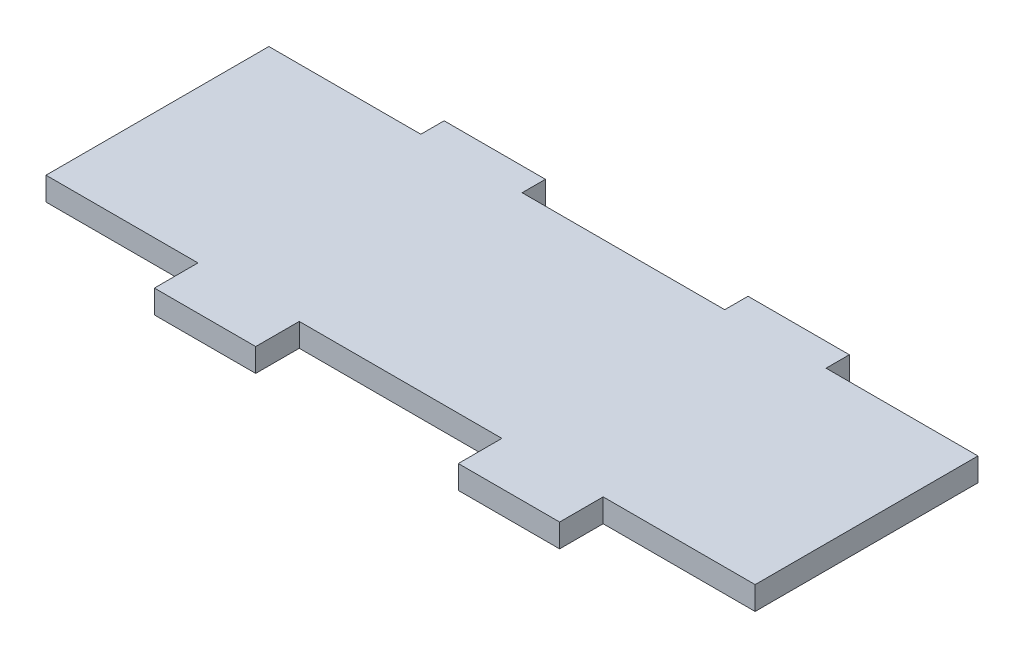
ISO-10303-21;
HEADER;
FILE_DESCRIPTION(('STEP AP214'),'2;1');
FILE_NAME('part.step','',(''),(''),'','','');
FILE_SCHEMA(('AUTOMOTIVE_DESIGN { 1 0 10303 214 1 1 1 1 }'));
ENDSEC;
DATA;
#1=APPLICATION_CONTEXT('core data for automotive mechanical design processes');
#2=APPLICATION_PROTOCOL_DEFINITION('international standard','automotive_design',2000,#1);
#3=PRODUCT_CONTEXT('',#1,'mechanical');
#4=PRODUCT('Part','Part','',(#3));
#5=PRODUCT_RELATED_PRODUCT_CATEGORY('part','',(#4));
#6=PRODUCT_DEFINITION_FORMATION('','',#4);
#7=PRODUCT_DEFINITION_CONTEXT('part definition',#1,'design');
#8=PRODUCT_DEFINITION('design','',#6,#7);
#9=PRODUCT_DEFINITION_SHAPE('','',#8);
#10=(LENGTH_UNIT() NAMED_UNIT(*) SI_UNIT(.MILLI.,.METRE.));
#11=(NAMED_UNIT(*) PLANE_ANGLE_UNIT() SI_UNIT($,.RADIAN.));
#12=(NAMED_UNIT(*) SI_UNIT($,.STERADIAN.) SOLID_ANGLE_UNIT());
#13=UNCERTAINTY_MEASURE_WITH_UNIT(LENGTH_MEASURE(1.E-05),#10,'distance_accuracy_value','');
#14=(GEOMETRIC_REPRESENTATION_CONTEXT(3) GLOBAL_UNCERTAINTY_ASSIGNED_CONTEXT((#13)) GLOBAL_UNIT_ASSIGNED_CONTEXT((#10,
#11,#12)) REPRESENTATION_CONTEXT('',''));
#15=CARTESIAN_POINT('',(0.,0.,0.));
#16=DIRECTION('',(0.,0.,1.));
#17=DIRECTION('',(1.,0.,0.));
#18=AXIS2_PLACEMENT_3D('',#15,#16,#17);
#19=CARTESIAN_POINT('',(0.,2.3,0.));
#20=DIRECTION('',(0.,0.,-1.));
#21=DIRECTION('',(-1.,0.,0.));
#22=AXIS2_PLACEMENT_3D('',#19,#20,#21);
#23=PLANE('',#22);
#24=DIRECTION('',(1.,0.,0.));
#25=VECTOR('',#24,1.);
#26=CARTESIAN_POINT('',(0.,0.,0.));
#27=LINE('',#26,#25);
#28=CARTESIAN_POINT('',(0.,0.,0.));
#29=VERTEX_POINT('',#28);
#30=CARTESIAN_POINT('',(15.,0.,0.));
#31=VERTEX_POINT('',#30);
#32=EDGE_CURVE('E201',#29,#31,#27,.T.);
#33=ORIENTED_EDGE('',*,*,#32,.T.);
#34=DIRECTION('',(0.,-1.,0.));
#35=VECTOR('',#34,1.);
#36=CARTESIAN_POINT('',(15.,2.3,0.));
#37=LINE('',#36,#35);
#38=CARTESIAN_POINT('',(15.,2.3,0.));
#39=VERTEX_POINT('',#38);
#40=EDGE_CURVE('E11',#39,#31,#37,.T.);
#41=ORIENTED_EDGE('',*,*,#40,.F.);
#42=DIRECTION('',(1.,0.,0.));
#43=VECTOR('',#42,1.);
#44=CARTESIAN_POINT('',(0.,2.3,0.));
#45=LINE('',#44,#43);
#46=CARTESIAN_POINT('',(0.,2.3,0.));
#47=VERTEX_POINT('',#46);
#48=EDGE_CURVE('E239',#47,#39,#45,.T.);
#49=ORIENTED_EDGE('',*,*,#48,.F.);
#50=DIRECTION('',(0.,-1.,0.));
#51=VECTOR('',#50,1.);
#52=CARTESIAN_POINT('',(0.,2.3,0.));
#53=LINE('',#52,#51);
#54=EDGE_CURVE('E197',#47,#29,#53,.T.);
#55=ORIENTED_EDGE('',*,*,#54,.T.);
#56=EDGE_LOOP('',(#33,#41,#49,#55));
#57=FACE_BOUND('',#56,.T.);
#58=ADVANCED_FACE('F33',(#57),#23,.F.);
#59=CARTESIAN_POINT('',(15.,2.3,0.));
#60=DIRECTION('',(1.,0.,0.));
#61=DIRECTION('',(0.,0.,-1.));
#62=AXIS2_PLACEMENT_3D('',#59,#60,#61);
#63=PLANE('',#62);
#64=DIRECTION('',(0.,0.,1.));
#65=VECTOR('',#64,1.);
#66=CARTESIAN_POINT('',(15.,0.,0.));
#67=LINE('',#66,#65);
#68=CARTESIAN_POINT('',(15.,0.,4.3));
#69=VERTEX_POINT('',#68);
#70=EDGE_CURVE('E204',#31,#69,#67,.T.);
#71=ORIENTED_EDGE('',*,*,#70,.T.);
#72=DIRECTION('',(0.,-1.,0.));
#73=VECTOR('',#72,1.);
#74=CARTESIAN_POINT('',(15.,2.3,4.3));
#75=LINE('',#74,#73);
#76=CARTESIAN_POINT('',(15.,2.3,4.3));
#77=VERTEX_POINT('',#76);
#78=EDGE_CURVE('E41',#77,#69,#75,.T.);
#79=ORIENTED_EDGE('',*,*,#78,.F.);
#80=DIRECTION('',(0.,0.,1.));
#81=VECTOR('',#80,1.);
#82=CARTESIAN_POINT('',(15.,2.3,0.));
#83=LINE('',#82,#81);
#84=EDGE_CURVE('E128',#39,#77,#83,.T.);
#85=ORIENTED_EDGE('',*,*,#84,.F.);
#86=ORIENTED_EDGE('',*,*,#40,.T.);
#87=EDGE_LOOP('',(#71,#79,#85,#86));
#88=FACE_BOUND('',#87,.T.);
#89=ADVANCED_FACE('F357',(#88),#63,.F.);
#90=CARTESIAN_POINT('',(15.,2.3,4.3));
#91=DIRECTION('',(0.,0.,-1.));
#92=DIRECTION('',(-1.,0.,0.));
#93=AXIS2_PLACEMENT_3D('',#90,#91,#92);
#94=PLANE('',#93);
#95=DIRECTION('',(1.,0.,0.));
#96=VECTOR('',#95,1.);
#97=CARTESIAN_POINT('',(15.,0.,4.3));
#98=LINE('',#97,#96);
#99=CARTESIAN_POINT('',(25.,0.,4.3));
#100=VERTEX_POINT('',#99);
#101=EDGE_CURVE('E206',#69,#100,#98,.T.);
#102=ORIENTED_EDGE('',*,*,#101,.T.);
#103=DIRECTION('',(0.,-1.,0.));
#104=VECTOR('',#103,1.);
#105=CARTESIAN_POINT('',(25.,2.3,4.3));
#106=LINE('',#105,#104);
#107=CARTESIAN_POINT('',(25.,2.3,4.3));
#108=VERTEX_POINT('',#107);
#109=EDGE_CURVE('E282',#108,#100,#106,.T.);
#110=ORIENTED_EDGE('',*,*,#109,.F.);
#111=DIRECTION('',(1.,0.,0.));
#112=VECTOR('',#111,1.);
#113=CARTESIAN_POINT('',(15.,2.3,4.3));
#114=LINE('',#113,#112);
#115=EDGE_CURVE('E290',#77,#108,#114,.T.);
#116=ORIENTED_EDGE('',*,*,#115,.F.);
#117=ORIENTED_EDGE('',*,*,#78,.T.);
#118=EDGE_LOOP('',(#102,#110,#116,#117));
#119=FACE_BOUND('',#118,.T.);
#120=ADVANCED_FACE('F288',(#119),#94,.F.);
#121=CARTESIAN_POINT('',(25.,2.3,4.3));
#122=DIRECTION('',(-1.,0.,0.));
#123=DIRECTION('',(0.,0.,1.));
#124=AXIS2_PLACEMENT_3D('',#121,#122,#123);
#125=PLANE('',#124);
#126=DIRECTION('',(0.,0.,-1.));
#127=VECTOR('',#126,1.);
#128=CARTESIAN_POINT('',(25.,0.,4.3));
#129=LINE('',#128,#127);
#130=CARTESIAN_POINT('',(25.,0.,0.));
#131=VERTEX_POINT('',#130);
#132=EDGE_CURVE('E208',#100,#131,#129,.T.);
#133=ORIENTED_EDGE('',*,*,#132,.T.);
#134=DIRECTION('',(0.,-1.,0.));
#135=VECTOR('',#134,1.);
#136=CARTESIAN_POINT('',(25.,2.3,0.));
#137=LINE('',#136,#135);
#138=CARTESIAN_POINT('',(25.,2.3,0.));
#139=VERTEX_POINT('',#138);
#140=EDGE_CURVE('E279',#139,#131,#137,.T.);
#141=ORIENTED_EDGE('',*,*,#140,.F.);
#142=DIRECTION('',(0.,0.,-1.));
#143=VECTOR('',#142,1.);
#144=CARTESIAN_POINT('',(25.,2.3,4.3));
#145=LINE('',#144,#143);
#146=EDGE_CURVE('E308',#108,#139,#145,.T.);
#147=ORIENTED_EDGE('',*,*,#146,.F.);
#148=ORIENTED_EDGE('',*,*,#109,.T.);
#149=EDGE_LOOP('',(#133,#141,#147,#148));
#150=FACE_BOUND('',#149,.T.);
#151=ADVANCED_FACE('F299',(#150),#125,.F.);
#152=CARTESIAN_POINT('',(25.,2.3,0.));
#153=DIRECTION('',(0.,0.,-1.));
#154=DIRECTION('',(-1.,0.,0.));
#155=AXIS2_PLACEMENT_3D('',#152,#153,#154);
#156=PLANE('',#155);
#157=DIRECTION('',(1.,0.,0.));
#158=VECTOR('',#157,1.);
#159=CARTESIAN_POINT('',(25.,0.,0.));
#160=LINE('',#159,#158);
#161=CARTESIAN_POINT('',(45.,0.,0.));
#162=VERTEX_POINT('',#161);
#163=EDGE_CURVE('E210',#131,#162,#160,.T.);
#164=ORIENTED_EDGE('',*,*,#163,.T.);
#165=DIRECTION('',(0.,-1.,0.));
#166=VECTOR('',#165,1.);
#167=CARTESIAN_POINT('',(45.,2.3,0.));
#168=LINE('',#167,#166);
#169=CARTESIAN_POINT('',(45.,2.3,0.));
#170=VERTEX_POINT('',#169);
#171=EDGE_CURVE('E276',#170,#162,#168,.T.);
#172=ORIENTED_EDGE('',*,*,#171,.F.);
#173=DIRECTION('',(1.,0.,0.));
#174=VECTOR('',#173,1.);
#175=CARTESIAN_POINT('',(25.,2.3,0.));
#176=LINE('',#175,#174);
#177=EDGE_CURVE('E305',#139,#170,#176,.T.);
#178=ORIENTED_EDGE('',*,*,#177,.F.);
#179=ORIENTED_EDGE('',*,*,#140,.T.);
#180=EDGE_LOOP('',(#164,#172,#178,#179));
#181=FACE_BOUND('',#180,.T.);
#182=ADVANCED_FACE('F303',(#181),#156,.F.);
#183=CARTESIAN_POINT('',(45.,2.3,0.));
#184=DIRECTION('',(1.,0.,0.));
#185=DIRECTION('',(0.,0.,-1.));
#186=AXIS2_PLACEMENT_3D('',#183,#184,#185);
#187=PLANE('',#186);
#188=DIRECTION('',(0.,0.,1.));
#189=VECTOR('',#188,1.);
#190=CARTESIAN_POINT('',(45.,0.,0.));
#191=LINE('',#190,#189);
#192=CARTESIAN_POINT('',(45.,0.,4.3));
#193=VERTEX_POINT('',#192);
#194=EDGE_CURVE('E212',#162,#193,#191,.T.);
#195=ORIENTED_EDGE('',*,*,#194,.T.);
#196=DIRECTION('',(0.,-1.,0.));
#197=VECTOR('',#196,1.);
#198=CARTESIAN_POINT('',(45.,2.3,4.3));
#199=LINE('',#198,#197);
#200=CARTESIAN_POINT('',(45.,2.3,4.3));
#201=VERTEX_POINT('',#200);
#202=EDGE_CURVE('E273',#201,#193,#199,.T.);
#203=ORIENTED_EDGE('',*,*,#202,.F.);
#204=DIRECTION('',(0.,0.,1.));
#205=VECTOR('',#204,1.);
#206=CARTESIAN_POINT('',(45.,2.3,0.));
#207=LINE('',#206,#205);
#208=EDGE_CURVE('E307',#170,#201,#207,.T.);
#209=ORIENTED_EDGE('',*,*,#208,.F.);
#210=ORIENTED_EDGE('',*,*,#171,.T.);
#211=EDGE_LOOP('',(#195,#203,#209,#210));
#212=FACE_BOUND('',#211,.T.);
#213=ADVANCED_FACE('F370',(#212),#187,.F.);
#214=CARTESIAN_POINT('',(45.,2.3,4.3));
#215=DIRECTION('',(0.,0.,-1.));
#216=DIRECTION('',(-1.,0.,0.));
#217=AXIS2_PLACEMENT_3D('',#214,#215,#216);
#218=PLANE('',#217);
#219=DIRECTION('',(1.,0.,0.));
#220=VECTOR('',#219,1.);
#221=CARTESIAN_POINT('',(45.,0.,4.3));
#222=LINE('',#221,#220);
#223=CARTESIAN_POINT('',(55.,0.,4.3));
#224=VERTEX_POINT('',#223);
#225=EDGE_CURVE('E214',#193,#224,#222,.T.);
#226=ORIENTED_EDGE('',*,*,#225,.T.);
#227=DIRECTION('',(0.,-1.,0.));
#228=VECTOR('',#227,1.);
#229=CARTESIAN_POINT('',(55.,2.3,4.3));
#230=LINE('',#229,#228);
#231=CARTESIAN_POINT('',(55.,2.3,4.3));
#232=VERTEX_POINT('',#231);
#233=EDGE_CURVE('E270',#232,#224,#230,.T.);
#234=ORIENTED_EDGE('',*,*,#233,.F.);
#235=DIRECTION('',(1.,0.,0.));
#236=VECTOR('',#235,1.);
#237=CARTESIAN_POINT('',(45.,2.3,4.3));
#238=LINE('',#237,#236);
#239=EDGE_CURVE('E310',#201,#232,#238,.T.);
#240=ORIENTED_EDGE('',*,*,#239,.F.);
#241=ORIENTED_EDGE('',*,*,#202,.T.);
#242=EDGE_LOOP('',(#226,#234,#240,#241));
#243=FACE_BOUND('',#242,.T.);
#244=ADVANCED_FACE('F373',(#243),#218,.F.);
#245=CARTESIAN_POINT('',(55.,2.3,4.3));
#246=DIRECTION('',(-1.,0.,0.));
#247=DIRECTION('',(0.,0.,1.));
#248=AXIS2_PLACEMENT_3D('',#245,#246,#247);
#249=PLANE('',#248);
#250=DIRECTION('',(0.,0.,-1.));
#251=VECTOR('',#250,1.);
#252=CARTESIAN_POINT('',(55.,0.,4.3));
#253=LINE('',#252,#251);
#254=CARTESIAN_POINT('',(55.,0.,0.));
#255=VERTEX_POINT('',#254);
#256=EDGE_CURVE('E216',#224,#255,#253,.T.);
#257=ORIENTED_EDGE('',*,*,#256,.T.);
#258=DIRECTION('',(0.,-1.,0.));
#259=VECTOR('',#258,1.);
#260=CARTESIAN_POINT('',(55.,2.3,0.));
#261=LINE('',#260,#259);
#262=CARTESIAN_POINT('',(55.,2.3,0.));
#263=VERTEX_POINT('',#262);
#264=EDGE_CURVE('E267',#263,#255,#261,.T.);
#265=ORIENTED_EDGE('',*,*,#264,.F.);
#266=DIRECTION('',(0.,0.,-1.));
#267=VECTOR('',#266,1.);
#268=CARTESIAN_POINT('',(55.,2.3,4.3));
#269=LINE('',#268,#267);
#270=EDGE_CURVE('E316',#232,#263,#269,.T.);
#271=ORIENTED_EDGE('',*,*,#270,.F.);
#272=ORIENTED_EDGE('',*,*,#233,.T.);
#273=EDGE_LOOP('',(#257,#265,#271,#272));
#274=FACE_BOUND('',#273,.T.);
#275=ADVANCED_FACE('F377',(#274),#249,.F.);
#276=CARTESIAN_POINT('',(55.,2.3,0.));
#277=DIRECTION('',(0.,0.,-1.));
#278=DIRECTION('',(-1.,0.,0.));
#279=AXIS2_PLACEMENT_3D('',#276,#277,#278);
#280=PLANE('',#279);
#281=DIRECTION('',(1.,0.,0.));
#282=VECTOR('',#281,1.);
#283=CARTESIAN_POINT('',(55.,0.,0.));
#284=LINE('',#283,#282);
#285=CARTESIAN_POINT('',(70.,0.,0.));
#286=VERTEX_POINT('',#285);
#287=EDGE_CURVE('E218',#255,#286,#284,.T.);
#288=ORIENTED_EDGE('',*,*,#287,.T.);
#289=DIRECTION('',(0.,-1.,0.));
#290=VECTOR('',#289,1.);
#291=CARTESIAN_POINT('',(70.,2.3,0.));
#292=LINE('',#291,#290);
#293=CARTESIAN_POINT('',(70.,2.3,0.));
#294=VERTEX_POINT('',#293);
#295=EDGE_CURVE('E264',#294,#286,#292,.T.);
#296=ORIENTED_EDGE('',*,*,#295,.F.);
#297=DIRECTION('',(1.,0.,0.));
#298=VECTOR('',#297,1.);
#299=CARTESIAN_POINT('',(55.,2.3,0.));
#300=LINE('',#299,#298);
#301=EDGE_CURVE('E318',#263,#294,#300,.T.);
#302=ORIENTED_EDGE('',*,*,#301,.F.);
#303=ORIENTED_EDGE('',*,*,#264,.T.);
#304=EDGE_LOOP('',(#288,#296,#302,#303));
#305=FACE_BOUND('',#304,.T.);
#306=ADVANCED_FACE('F381',(#305),#280,.F.);
#307=CARTESIAN_POINT('',(70.,2.3,-22.));
#308=DIRECTION('',(-1.,0.,0.));
#309=DIRECTION('',(0.,0.,1.));
#310=AXIS2_PLACEMENT_3D('',#307,#308,#309);
#311=PLANE('',#310);
#312=DIRECTION('',(0.,0.,-1.));
#313=VECTOR('',#312,1.);
#314=CARTESIAN_POINT('',(70.,0.,-22.));
#315=LINE('',#314,#313);
#316=CARTESIAN_POINT('',(70.,0.,-22.));
#317=VERTEX_POINT('',#316);
#318=EDGE_CURVE('E220',#286,#317,#315,.T.);
#319=ORIENTED_EDGE('',*,*,#318,.T.);
#320=DIRECTION('',(0.,-1.,0.));
#321=VECTOR('',#320,1.);
#322=CARTESIAN_POINT('',(70.,2.3,-22.));
#323=LINE('',#322,#321);
#324=CARTESIAN_POINT('',(70.,2.3,-22.));
#325=VERTEX_POINT('',#324);
#326=EDGE_CURVE('E261',#325,#317,#323,.T.);
#327=ORIENTED_EDGE('',*,*,#326,.F.);
#328=DIRECTION('',(0.,0.,-1.));
#329=VECTOR('',#328,1.);
#330=CARTESIAN_POINT('',(70.,2.3,-22.));
#331=LINE('',#330,#329);
#332=EDGE_CURVE('E320',#294,#325,#331,.T.);
#333=ORIENTED_EDGE('',*,*,#332,.F.);
#334=ORIENTED_EDGE('',*,*,#295,.T.);
#335=EDGE_LOOP('',(#319,#327,#333,#334));
#336=FACE_BOUND('',#335,.T.);
#337=ADVANCED_FACE('F385',(#336),#311,.F.);
#338=CARTESIAN_POINT('',(55.,2.3,-22.));
#339=DIRECTION('',(0.,0.,1.));
#340=DIRECTION('',(1.,0.,0.));
#341=AXIS2_PLACEMENT_3D('',#338,#339,#340);
#342=PLANE('',#341);
#343=DIRECTION('',(-1.,0.,0.));
#344=VECTOR('',#343,1.);
#345=CARTESIAN_POINT('',(55.,0.,-22.));
#346=LINE('',#345,#344);
#347=CARTESIAN_POINT('',(55.,0.,-22.));
#348=VERTEX_POINT('',#347);
#349=EDGE_CURVE('E222',#317,#348,#346,.T.);
#350=ORIENTED_EDGE('',*,*,#349,.T.);
#351=DIRECTION('',(0.,-1.,0.));
#352=VECTOR('',#351,1.);
#353=CARTESIAN_POINT('',(55.,2.3,-22.));
#354=LINE('',#353,#352);
#355=CARTESIAN_POINT('',(55.,2.3,-22.));
#356=VERTEX_POINT('',#355);
#357=EDGE_CURVE('E258',#356,#348,#354,.T.);
#358=ORIENTED_EDGE('',*,*,#357,.F.);
#359=DIRECTION('',(-1.,0.,0.));
#360=VECTOR('',#359,1.);
#361=CARTESIAN_POINT('',(55.,2.3,-22.));
#362=LINE('',#361,#360);
#363=EDGE_CURVE('E322',#325,#356,#362,.T.);
#364=ORIENTED_EDGE('',*,*,#363,.F.);
#365=ORIENTED_EDGE('',*,*,#326,.T.);
#366=EDGE_LOOP('',(#350,#358,#364,#365));
#367=FACE_BOUND('',#366,.T.);
#368=ADVANCED_FACE('F389',(#367),#342,.F.);
#369=CARTESIAN_POINT('',(55.,2.3,-24.3));
#370=DIRECTION('',(-1.,0.,0.));
#371=DIRECTION('',(0.,0.,1.));
#372=AXIS2_PLACEMENT_3D('',#369,#370,#371);
#373=PLANE('',#372);
#374=DIRECTION('',(0.,0.,-1.));
#375=VECTOR('',#374,1.);
#376=CARTESIAN_POINT('',(55.,0.,-24.3));
#377=LINE('',#376,#375);
#378=CARTESIAN_POINT('',(55.,0.,-24.3));
#379=VERTEX_POINT('',#378);
#380=EDGE_CURVE('E224',#348,#379,#377,.T.);
#381=ORIENTED_EDGE('',*,*,#380,.T.);
#382=DIRECTION('',(0.,-1.,0.));
#383=VECTOR('',#382,1.);
#384=CARTESIAN_POINT('',(55.,2.3,-24.3));
#385=LINE('',#384,#383);
#386=CARTESIAN_POINT('',(55.,2.3,-24.3));
#387=VERTEX_POINT('',#386);
#388=EDGE_CURVE('E255',#387,#379,#385,.T.);
#389=ORIENTED_EDGE('',*,*,#388,.F.);
#390=DIRECTION('',(0.,0.,-1.));
#391=VECTOR('',#390,1.);
#392=CARTESIAN_POINT('',(55.,2.3,-24.3));
#393=LINE('',#392,#391);
#394=EDGE_CURVE('E324',#356,#387,#393,.T.);
#395=ORIENTED_EDGE('',*,*,#394,.F.);
#396=ORIENTED_EDGE('',*,*,#357,.T.);
#397=EDGE_LOOP('',(#381,#389,#395,#396));
#398=FACE_BOUND('',#397,.T.);
#399=ADVANCED_FACE('F393',(#398),#373,.F.);
#400=CARTESIAN_POINT('',(45.,2.3,-24.3));
#401=DIRECTION('',(0.,0.,1.));
#402=DIRECTION('',(1.,0.,0.));
#403=AXIS2_PLACEMENT_3D('',#400,#401,#402);
#404=PLANE('',#403);
#405=DIRECTION('',(-1.,0.,0.));
#406=VECTOR('',#405,1.);
#407=CARTESIAN_POINT('',(45.,0.,-24.3));
#408=LINE('',#407,#406);
#409=CARTESIAN_POINT('',(45.,0.,-24.3));
#410=VERTEX_POINT('',#409);
#411=EDGE_CURVE('E226',#379,#410,#408,.T.);
#412=ORIENTED_EDGE('',*,*,#411,.T.);
#413=DIRECTION('',(0.,-1.,0.));
#414=VECTOR('',#413,1.);
#415=CARTESIAN_POINT('',(45.,2.3,-24.3));
#416=LINE('',#415,#414);
#417=CARTESIAN_POINT('',(45.,2.3,-24.3));
#418=VERTEX_POINT('',#417);
#419=EDGE_CURVE('E252',#418,#410,#416,.T.);
#420=ORIENTED_EDGE('',*,*,#419,.F.);
#421=DIRECTION('',(-1.,0.,0.));
#422=VECTOR('',#421,1.);
#423=CARTESIAN_POINT('',(45.,2.3,-24.3));
#424=LINE('',#423,#422);
#425=EDGE_CURVE('E326',#387,#418,#424,.T.);
#426=ORIENTED_EDGE('',*,*,#425,.F.);
#427=ORIENTED_EDGE('',*,*,#388,.T.);
#428=EDGE_LOOP('',(#412,#420,#426,#427));
#429=FACE_BOUND('',#428,.T.);
#430=ADVANCED_FACE('F397',(#429),#404,.F.);
#431=CARTESIAN_POINT('',(45.,2.3,-22.));
#432=DIRECTION('',(1.,0.,0.));
#433=DIRECTION('',(0.,0.,-1.));
#434=AXIS2_PLACEMENT_3D('',#431,#432,#433);
#435=PLANE('',#434);
#436=DIRECTION('',(0.,0.,1.));
#437=VECTOR('',#436,1.);
#438=CARTESIAN_POINT('',(45.,0.,-22.));
#439=LINE('',#438,#437);
#440=CARTESIAN_POINT('',(45.,0.,-22.));
#441=VERTEX_POINT('',#440);
#442=EDGE_CURVE('E228',#410,#441,#439,.T.);
#443=ORIENTED_EDGE('',*,*,#442,.T.);
#444=DIRECTION('',(0.,-1.,0.));
#445=VECTOR('',#444,1.);
#446=CARTESIAN_POINT('',(45.,2.3,-22.));
#447=LINE('',#446,#445);
#448=CARTESIAN_POINT('',(45.,2.3,-22.));
#449=VERTEX_POINT('',#448);
#450=EDGE_CURVE('E249',#449,#441,#447,.T.);
#451=ORIENTED_EDGE('',*,*,#450,.F.);
#452=DIRECTION('',(0.,0.,1.));
#453=VECTOR('',#452,1.);
#454=CARTESIAN_POINT('',(45.,2.3,-22.));
#455=LINE('',#454,#453);
#456=EDGE_CURVE('E328',#418,#449,#455,.T.);
#457=ORIENTED_EDGE('',*,*,#456,.F.);
#458=ORIENTED_EDGE('',*,*,#419,.T.);
#459=EDGE_LOOP('',(#443,#451,#457,#458));
#460=FACE_BOUND('',#459,.T.);
#461=ADVANCED_FACE('F401',(#460),#435,.F.);
#462=CARTESIAN_POINT('',(25.,2.3,-22.));
#463=DIRECTION('',(0.,0.,1.));
#464=DIRECTION('',(1.,0.,0.));
#465=AXIS2_PLACEMENT_3D('',#462,#463,#464);
#466=PLANE('',#465);
#467=DIRECTION('',(-1.,0.,0.));
#468=VECTOR('',#467,1.);
#469=CARTESIAN_POINT('',(25.,0.,-22.));
#470=LINE('',#469,#468);
#471=CARTESIAN_POINT('',(25.,0.,-22.));
#472=VERTEX_POINT('',#471);
#473=EDGE_CURVE('E230',#441,#472,#470,.T.);
#474=ORIENTED_EDGE('',*,*,#473,.T.);
#475=DIRECTION('',(0.,-1.,0.));
#476=VECTOR('',#475,1.);
#477=CARTESIAN_POINT('',(25.,2.3,-22.));
#478=LINE('',#477,#476);
#479=CARTESIAN_POINT('',(25.,2.3,-22.));
#480=VERTEX_POINT('',#479);
#481=EDGE_CURVE('E246',#480,#472,#478,.T.);
#482=ORIENTED_EDGE('',*,*,#481,.F.);
#483=DIRECTION('',(-1.,0.,0.));
#484=VECTOR('',#483,1.);
#485=CARTESIAN_POINT('',(25.,2.3,-22.));
#486=LINE('',#485,#484);
#487=EDGE_CURVE('E330',#449,#480,#486,.T.);
#488=ORIENTED_EDGE('',*,*,#487,.F.);
#489=ORIENTED_EDGE('',*,*,#450,.T.);
#490=EDGE_LOOP('',(#474,#482,#488,#489));
#491=FACE_BOUND('',#490,.T.);
#492=ADVANCED_FACE('F405',(#491),#466,.F.);
#493=CARTESIAN_POINT('',(25.,2.3,-24.3));
#494=DIRECTION('',(-1.,0.,0.));
#495=DIRECTION('',(0.,0.,1.));
#496=AXIS2_PLACEMENT_3D('',#493,#494,#495);
#497=PLANE('',#496);
#498=DIRECTION('',(0.,0.,-1.));
#499=VECTOR('',#498,1.);
#500=CARTESIAN_POINT('',(25.,0.,-24.3));
#501=LINE('',#500,#499);
#502=CARTESIAN_POINT('',(25.,0.,-24.3));
#503=VERTEX_POINT('',#502);
#504=EDGE_CURVE('E232',#472,#503,#501,.T.);
#505=ORIENTED_EDGE('',*,*,#504,.T.);
#506=DIRECTION('',(0.,-1.,0.));
#507=VECTOR('',#506,1.);
#508=CARTESIAN_POINT('',(25.,2.3,-24.3));
#509=LINE('',#508,#507);
#510=CARTESIAN_POINT('',(25.,2.3,-24.3));
#511=VERTEX_POINT('',#510);
#512=EDGE_CURVE('E243',#511,#503,#509,.T.);
#513=ORIENTED_EDGE('',*,*,#512,.F.);
#514=DIRECTION('',(0.,0.,-1.));
#515=VECTOR('',#514,1.);
#516=CARTESIAN_POINT('',(25.,2.3,-24.3));
#517=LINE('',#516,#515);
#518=EDGE_CURVE('E332',#480,#511,#517,.T.);
#519=ORIENTED_EDGE('',*,*,#518,.F.);
#520=ORIENTED_EDGE('',*,*,#481,.T.);
#521=EDGE_LOOP('',(#505,#513,#519,#520));
#522=FACE_BOUND('',#521,.T.);
#523=ADVANCED_FACE('F338',(#522),#497,.F.);
#524=CARTESIAN_POINT('',(15.,2.3,-24.3));
#525=DIRECTION('',(0.,0.,1.));
#526=DIRECTION('',(1.,0.,0.));
#527=AXIS2_PLACEMENT_3D('',#524,#525,#526);
#528=PLANE('',#527);
#529=DIRECTION('',(-1.,0.,0.));
#530=VECTOR('',#529,1.);
#531=CARTESIAN_POINT('',(15.,0.,-24.3));
#532=LINE('',#531,#530);
#533=CARTESIAN_POINT('',(15.,0.,-24.3));
#534=VERTEX_POINT('',#533);
#535=EDGE_CURVE('E234',#503,#534,#532,.T.);
#536=ORIENTED_EDGE('',*,*,#535,.T.);
#537=DIRECTION('',(0.,-1.,0.));
#538=VECTOR('',#537,1.);
#539=CARTESIAN_POINT('',(15.,2.3,-24.3));
#540=LINE('',#539,#538);
#541=CARTESIAN_POINT('',(15.,2.3,-24.3));
#542=VERTEX_POINT('',#541);
#543=EDGE_CURVE('E192',#542,#534,#540,.T.);
#544=ORIENTED_EDGE('',*,*,#543,.F.);
#545=DIRECTION('',(-1.,0.,0.));
#546=VECTOR('',#545,1.);
#547=CARTESIAN_POINT('',(15.,2.3,-24.3));
#548=LINE('',#547,#546);
#549=EDGE_CURVE('E183',#511,#542,#548,.T.);
#550=ORIENTED_EDGE('',*,*,#549,.F.);
#551=ORIENTED_EDGE('',*,*,#512,.T.);
#552=EDGE_LOOP('',(#536,#544,#550,#551));
#553=FACE_BOUND('',#552,.T.);
#554=ADVANCED_FACE('F342',(#553),#528,.F.);
#555=CARTESIAN_POINT('',(15.,2.3,-22.));
#556=DIRECTION('',(1.,0.,0.));
#557=DIRECTION('',(0.,0.,-1.));
#558=AXIS2_PLACEMENT_3D('',#555,#556,#557);
#559=PLANE('',#558);
#560=DIRECTION('',(0.,0.,1.));
#561=VECTOR('',#560,1.);
#562=CARTESIAN_POINT('',(15.,0.,-22.));
#563=LINE('',#562,#561);
#564=CARTESIAN_POINT('',(15.,0.,-22.));
#565=VERTEX_POINT('',#564);
#566=EDGE_CURVE('E191',#534,#565,#563,.T.);
#567=ORIENTED_EDGE('',*,*,#566,.T.);
#568=DIRECTION('',(0.,-1.,0.));
#569=VECTOR('',#568,1.);
#570=CARTESIAN_POINT('',(15.,2.3,-22.));
#571=LINE('',#570,#569);
#572=CARTESIAN_POINT('',(15.,2.3,-22.));
#573=VERTEX_POINT('',#572);
#574=EDGE_CURVE('E188',#573,#565,#571,.T.);
#575=ORIENTED_EDGE('',*,*,#574,.F.);
#576=DIRECTION('',(0.,0.,1.));
#577=VECTOR('',#576,1.);
#578=CARTESIAN_POINT('',(15.,2.3,-22.));
#579=LINE('',#578,#577);
#580=EDGE_CURVE('E177',#542,#573,#579,.T.);
#581=ORIENTED_EDGE('',*,*,#580,.F.);
#582=ORIENTED_EDGE('',*,*,#543,.T.);
#583=EDGE_LOOP('',(#567,#575,#581,#582));
#584=FACE_BOUND('',#583,.T.);
#585=ADVANCED_FACE('F189',(#584),#559,.F.);
#586=CARTESIAN_POINT('',(0.,2.3,-22.));
#587=DIRECTION('',(0.,0.,1.));
#588=DIRECTION('',(1.,0.,0.));
#589=AXIS2_PLACEMENT_3D('',#586,#587,#588);
#590=PLANE('',#589);
#591=DIRECTION('',(-1.,0.,0.));
#592=VECTOR('',#591,1.);
#593=CARTESIAN_POINT('',(0.,0.,-22.));
#594=LINE('',#593,#592);
#595=CARTESIAN_POINT('',(0.,0.,-22.));
#596=VERTEX_POINT('',#595);
#597=EDGE_CURVE('E114',#565,#596,#594,.T.);
#598=ORIENTED_EDGE('',*,*,#597,.T.);
#599=DIRECTION('',(0.,-1.,0.));
#600=VECTOR('',#599,1.);
#601=CARTESIAN_POINT('',(0.,2.3,-22.));
#602=LINE('',#601,#600);
#603=CARTESIAN_POINT('',(0.,2.3,-22.));
#604=VERTEX_POINT('',#603);
#605=EDGE_CURVE('E193',#604,#596,#602,.T.);
#606=ORIENTED_EDGE('',*,*,#605,.F.);
#607=DIRECTION('',(-1.,0.,0.));
#608=VECTOR('',#607,1.);
#609=CARTESIAN_POINT('',(0.,2.3,-22.));
#610=LINE('',#609,#608);
#611=EDGE_CURVE('E181',#573,#604,#610,.T.);
#612=ORIENTED_EDGE('',*,*,#611,.F.);
#613=ORIENTED_EDGE('',*,*,#574,.T.);
#614=EDGE_LOOP('',(#598,#606,#612,#613));
#615=FACE_BOUND('',#614,.T.);
#616=ADVANCED_FACE('F195',(#615),#590,.F.);
#617=CARTESIAN_POINT('',(0.,2.3,0.));
#618=DIRECTION('',(1.,0.,0.));
#619=DIRECTION('',(0.,0.,-1.));
#620=AXIS2_PLACEMENT_3D('',#617,#618,#619);
#621=PLANE('',#620);
#622=DIRECTION('',(0.,0.,1.));
#623=VECTOR('',#622,1.);
#624=CARTESIAN_POINT('',(0.,0.,0.));
#625=LINE('',#624,#623);
#626=EDGE_CURVE('E120',#596,#29,#625,.T.);
#627=ORIENTED_EDGE('',*,*,#626,.T.);
#628=ORIENTED_EDGE('',*,*,#54,.F.);
#629=DIRECTION('',(0.,0.,1.));
#630=VECTOR('',#629,1.);
#631=CARTESIAN_POINT('',(0.,2.3,0.));
#632=LINE('',#631,#630);
#633=EDGE_CURVE('E49',#604,#47,#632,.T.);
#634=ORIENTED_EDGE('',*,*,#633,.F.);
#635=ORIENTED_EDGE('',*,*,#605,.T.);
#636=EDGE_LOOP('',(#627,#628,#634,#635));
#637=FACE_BOUND('',#636,.T.);
#638=ADVANCED_FACE('F346',(#637),#621,.F.);
#639=CARTESIAN_POINT('',(0.,2.3,0.));
#640=DIRECTION('',(0.,-1.,0.));
#641=DIRECTION('',(0.,0.,-1.));
#642=AXIS2_PLACEMENT_3D('',#639,#640,#641);
#643=PLANE('',#642);
#644=ORIENTED_EDGE('',*,*,#48,.T.);
#645=ORIENTED_EDGE('',*,*,#84,.T.);
#646=ORIENTED_EDGE('',*,*,#115,.T.);
#647=ORIENTED_EDGE('',*,*,#146,.T.);
#648=ORIENTED_EDGE('',*,*,#177,.T.);
#649=ORIENTED_EDGE('',*,*,#208,.T.);
#650=ORIENTED_EDGE('',*,*,#239,.T.);
#651=ORIENTED_EDGE('',*,*,#270,.T.);
#652=ORIENTED_EDGE('',*,*,#301,.T.);
#653=ORIENTED_EDGE('',*,*,#332,.T.);
#654=ORIENTED_EDGE('',*,*,#363,.T.);
#655=ORIENTED_EDGE('',*,*,#394,.T.);
#656=ORIENTED_EDGE('',*,*,#425,.T.);
#657=ORIENTED_EDGE('',*,*,#456,.T.);
#658=ORIENTED_EDGE('',*,*,#487,.T.);
#659=ORIENTED_EDGE('',*,*,#518,.T.);
#660=ORIENTED_EDGE('',*,*,#549,.T.);
#661=ORIENTED_EDGE('',*,*,#580,.T.);
#662=ORIENTED_EDGE('',*,*,#611,.T.);
#663=ORIENTED_EDGE('',*,*,#633,.T.);
#664=EDGE_LOOP('',(#644,#645,#646,#647,#648,#649,#650,#651,#652,#653,#654,#655,#656,#657,#658,
#659,#660,#661,#662,#663));
#665=FACE_BOUND('',#664,.T.);
#666=ADVANCED_FACE('F179',(#665),#643,.F.);
#667=CARTESIAN_POINT('',(0.,0.,0.));
#668=DIRECTION('',(0.,-1.,0.));
#669=DIRECTION('',(0.,0.,-1.));
#670=AXIS2_PLACEMENT_3D('',#667,#668,#669);
#671=PLANE('',#670);
#672=ORIENTED_EDGE('',*,*,#32,.F.);
#673=ORIENTED_EDGE('',*,*,#626,.F.);
#674=ORIENTED_EDGE('',*,*,#597,.F.);
#675=ORIENTED_EDGE('',*,*,#566,.F.);
#676=ORIENTED_EDGE('',*,*,#535,.F.);
#677=ORIENTED_EDGE('',*,*,#504,.F.);
#678=ORIENTED_EDGE('',*,*,#473,.F.);
#679=ORIENTED_EDGE('',*,*,#442,.F.);
#680=ORIENTED_EDGE('',*,*,#411,.F.);
#681=ORIENTED_EDGE('',*,*,#380,.F.);
#682=ORIENTED_EDGE('',*,*,#349,.F.);
#683=ORIENTED_EDGE('',*,*,#318,.F.);
#684=ORIENTED_EDGE('',*,*,#287,.F.);
#685=ORIENTED_EDGE('',*,*,#256,.F.);
#686=ORIENTED_EDGE('',*,*,#225,.F.);
#687=ORIENTED_EDGE('',*,*,#194,.F.);
#688=ORIENTED_EDGE('',*,*,#163,.F.);
#689=ORIENTED_EDGE('',*,*,#132,.F.);
#690=ORIENTED_EDGE('',*,*,#101,.F.);
#691=ORIENTED_EDGE('',*,*,#70,.F.);
#692=EDGE_LOOP('',(#672,#673,#674,#675,#676,#677,#678,#679,#680,#681,#682,#683,#684,#685,#686,
#687,#688,#689,#690,#691));
#693=FACE_BOUND('',#692,.T.);
#694=ADVANCED_FACE('F294',(#693),#671,.T.);
#695=CLOSED_SHELL('',(#58,#89,#120,#151,#182,#213,#244,#275,#306,#337,#368,#399,#430,#461,#492,
#523,#554,#585,#616,#638,#666,#694));
#696=MANIFOLD_SOLID_BREP('B2',#695);
#697=ADVANCED_BREP_SHAPE_REPRESENTATION('',(#18,#696),#14);
#698=SHAPE_DEFINITION_REPRESENTATION(#9,#697);
ENDSEC;
END-ISO-10303-21;
